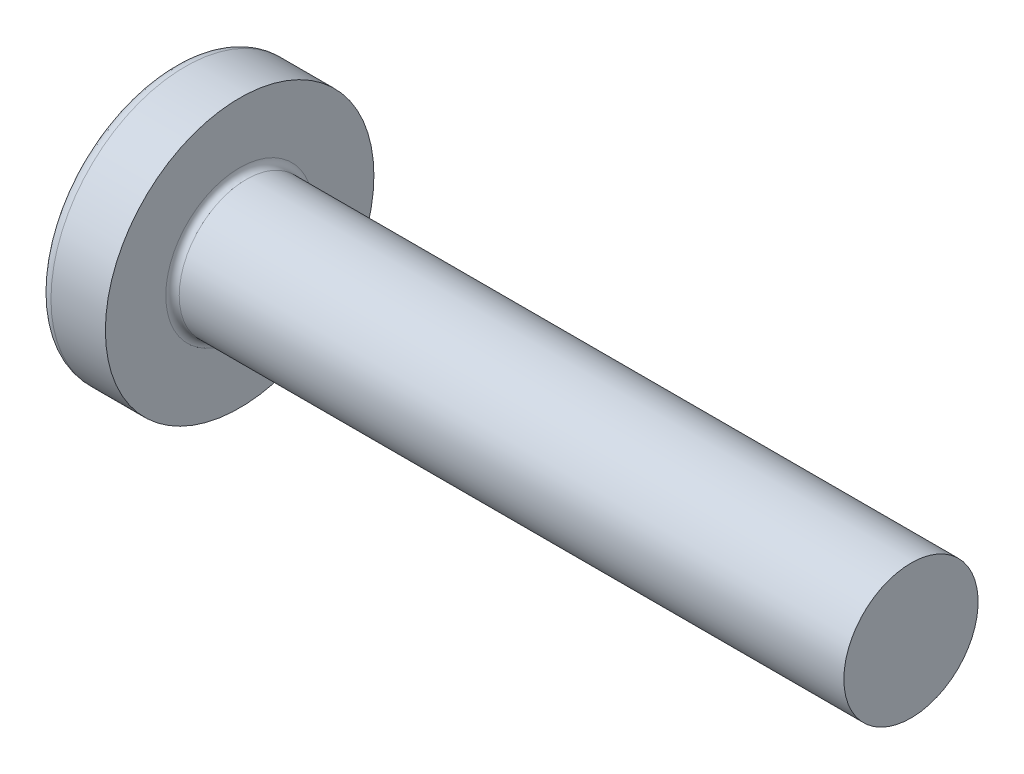
ISO-10303-21;
HEADER;
FILE_DESCRIPTION(('STEP AP214'),'2;1');
FILE_NAME('part.step','',(''),(''),'','','');
FILE_SCHEMA(('AUTOMOTIVE_DESIGN { 1 0 10303 214 1 1 1 1 }'));
ENDSEC;
DATA;
#1=APPLICATION_CONTEXT('core data for automotive mechanical design processes');
#2=APPLICATION_PROTOCOL_DEFINITION('international standard','automotive_design',2000,#1);
#3=PRODUCT_CONTEXT('',#1,'mechanical');
#4=PRODUCT('Part','Part','',(#3));
#5=PRODUCT_RELATED_PRODUCT_CATEGORY('part','',(#4));
#6=PRODUCT_DEFINITION_FORMATION('','',#4);
#7=PRODUCT_DEFINITION_CONTEXT('part definition',#1,'design');
#8=PRODUCT_DEFINITION('design','',#6,#7);
#9=PRODUCT_DEFINITION_SHAPE('','',#8);
#10=(LENGTH_UNIT() NAMED_UNIT(*) SI_UNIT(.MILLI.,.METRE.));
#11=(NAMED_UNIT(*) PLANE_ANGLE_UNIT() SI_UNIT($,.RADIAN.));
#12=(NAMED_UNIT(*) SI_UNIT($,.STERADIAN.) SOLID_ANGLE_UNIT());
#13=UNCERTAINTY_MEASURE_WITH_UNIT(LENGTH_MEASURE(1.E-05),#10,'distance_accuracy_value','');
#14=(GEOMETRIC_REPRESENTATION_CONTEXT(3) GLOBAL_UNCERTAINTY_ASSIGNED_CONTEXT((#13)) GLOBAL_UNIT_ASSIGNED_CONTEXT((#10,
#11,#12)) REPRESENTATION_CONTEXT('',''));
#15=CARTESIAN_POINT('',(0.,0.,0.));
#16=DIRECTION('',(0.,0.,1.));
#17=DIRECTION('',(1.,0.,0.));
#18=AXIS2_PLACEMENT_3D('',#15,#16,#17);
#19=CARTESIAN_POINT('',(0.,1.05,0.24));
#20=DIRECTION('',(-0.388390606151692,-0.921494838321475,0.));
#21=DIRECTION('',(0.921494838321475,-0.388390606151692,0.));
#22=AXIS2_PLACEMENT_3D('',#19,#20,#21);
#23=PLANE('',#22);
#24=DIRECTION('',(0.,0.,1.));
#25=VECTOR('',#24,1.);
#26=CARTESIAN_POINT('',(1.42,0.4515,0.24));
#27=LINE('',#26,#25);
#28=CARTESIAN_POINT('',(1.42,0.4515,-0.24));
#29=VERTEX_POINT('',#28);
#30=CARTESIAN_POINT('',(1.42,0.4515,0.24));
#31=VERTEX_POINT('',#30);
#32=EDGE_CURVE('E157',#29,#31,#27,.T.);
#33=ORIENTED_EDGE('',*,*,#32,.T.);
#34=DIRECTION('',(0.921494838321475,-0.388390606151692,0.));
#35=VECTOR('',#34,1.);
#36=CARTESIAN_POINT('',(0.163567582431044,0.981059719658465,0.24));
#37=LINE('',#36,#35);
#38=CARTESIAN_POINT('',(0.163567582431044,0.981059719658465,0.24));
#39=VERTEX_POINT('',#38);
#40=EDGE_CURVE('E155',#39,#31,#37,.T.);
#41=ORIENTED_EDGE('',*,*,#40,.F.);
#42=CARTESIAN_POINT('',(0.163567582431044,0.981059719658465,0.24));
#43=CARTESIAN_POINT('',(0.155231443530141,0.984573226089585,0.120170491540018));
#44=CARTESIAN_POINT('',(0.155231443530141,0.984573226089585,0.));
#45=B_SPLINE_CURVE_WITH_KNOTS('',2,(#42,#43,#44),.UNSPECIFIED.,.F.,.F.,(3,3),(0.,1.),.UNSPECIFIED.);
#46=CARTESIAN_POINT('',(0.155231443530141,0.984573226089585,0.));
#47=VERTEX_POINT('',#46);
#48=EDGE_CURVE('E143',#39,#47,#45,.T.);
#49=ORIENTED_EDGE('',*,*,#48,.T.);
#50=CARTESIAN_POINT('',(0.155231443530141,0.984573226089585,0.));
#51=CARTESIAN_POINT('',(0.155231443530141,0.984573226089585,-0.120170491540018));
#52=CARTESIAN_POINT('',(0.163567582431044,0.981059719658465,-0.24));
#53=B_SPLINE_CURVE_WITH_KNOTS('',2,(#50,#51,#52),.UNSPECIFIED.,.F.,.F.,(3,3),(0.,1.),.UNSPECIFIED.);
#54=CARTESIAN_POINT('',(0.163567582431044,0.981059719658465,-0.24));
#55=VERTEX_POINT('',#54);
#56=EDGE_CURVE('E150',#47,#55,#53,.T.);
#57=ORIENTED_EDGE('',*,*,#56,.T.);
#58=DIRECTION('',(-0.921494838321475,0.388390606151692,0.));
#59=VECTOR('',#58,1.);
#60=CARTESIAN_POINT('',(1.42,0.4515,-0.24));
#61=LINE('',#60,#59);
#62=EDGE_CURVE('E320',#29,#55,#61,.T.);
#63=ORIENTED_EDGE('',*,*,#62,.F.);
#64=EDGE_LOOP('',(#33,#41,#49,#57,#63));
#65=FACE_BOUND('',#64,.T.);
#66=ADVANCED_FACE('F15',(#65),#23,.T.);
#67=CARTESIAN_POINT('',(1.42,-0.4515,0.24));
#68=DIRECTION('',(0.,0.,-1.));
#69=DIRECTION('',(-1.,0.,0.));
#70=AXIS2_PLACEMENT_3D('',#67,#68,#69);
#71=PLANE('',#70);
#72=CARTESIAN_POINT('',(0.0321614467929396,0.383665089387867,0.24));
#73=CARTESIAN_POINT('',(0.0444976343759101,0.485334793650666,0.24));
#74=CARTESIAN_POINT('',(0.0616162394705707,0.585952531637949,0.24));
#75=CARTESIAN_POINT('',(0.105418284683272,0.785084075061481,0.24));
#76=CARTESIAN_POINT('',(0.132101724801313,0.883597880497731,0.239999999999999));
#77=CARTESIAN_POINT('',(0.163567582431044,0.981059719658465,0.239999999999999));
#78=B_SPLINE_CURVE_WITH_KNOTS('',3,(#72,#73,#74,#75,#76,#77),.UNSPECIFIED.,.F.,.F.,(4,2,4),(0.,
0.306190761687187,0.612381523374373),.UNSPECIFIED.);
#79=CARTESIAN_POINT('',(0.032161446788919,0.383665089389982,0.24));
#80=VERTEX_POINT('',#79);
#81=EDGE_CURVE('E147',#80,#39,#78,.T.);
#82=ORIENTED_EDGE('',*,*,#81,.T.);
#83=ORIENTED_EDGE('',*,*,#40,.T.);
#84=DIRECTION('',(0.,1.,0.));
#85=VECTOR('',#84,1.);
#86=CARTESIAN_POINT('',(1.42,-0.4515,0.24));
#87=LINE('',#86,#85);
#88=CARTESIAN_POINT('',(1.41999999999802,0.26225989018342,0.24));
#89=VERTEX_POINT('',#88);
#90=EDGE_CURVE('E165',#31,#89,#87,.F.);
#91=ORIENTED_EDGE('',*,*,#90,.T.);
#92=CARTESIAN_POINT('',(1.41999999999841,0.262259890181985,0.24));
#93=CARTESIAN_POINT('',(1.30971853065552,0.272703075671528,0.24));
#94=CARTESIAN_POINT('',(1.19941281358987,0.282885058267275,0.24));
#95=CARTESIAN_POINT('',(0.978765100194828,0.302838125701648,0.24));
#96=CARTESIAN_POINT('',(0.868423104182624,0.312609214041361,0.24));
#97=CARTESIAN_POINT('',(0.637110468045807,0.332776589227516,0.24));
#98=CARTESIAN_POINT('',(0.516137215606976,0.34314274696915,0.24));
#99=CARTESIAN_POINT('',(0.274165845082313,0.363594581443375,0.24));
#100=CARTESIAN_POINT('',(0.153167726776626,0.373680255578174,0.24));
#101=CARTESIAN_POINT('',(0.0321614467849463,0.383665089392646,0.24));
#102=B_SPLINE_CURVE_WITH_KNOTS('',3,(#92,#93,#94,#95,#96,#97,#98,#99,#100,#101),.UNSPECIFIED.,
.F.,.F.,(4,2,2,2,4),(0.,0.332323481469139,0.664644130753101,1.02889353261032,1.39314630695971),.UNSPECIFIED.);
#103=EDGE_CURVE('E163',#89,#80,#102,.T.);
#104=ORIENTED_EDGE('',*,*,#103,.T.);
#105=EDGE_LOOP('',(#82,#83,#91,#104));
#106=FACE_BOUND('',#105,.T.);
#107=ADVANCED_FACE('F161',(#106),#71,.T.);
#108=CARTESIAN_POINT('',(1.42,0.4515,-0.24));
#109=DIRECTION('',(0.,0.,1.));
#110=DIRECTION('',(1.,0.,0.));
#111=AXIS2_PLACEMENT_3D('',#108,#109,#110);
#112=PLANE('',#111);
#113=DIRECTION('',(0.,1.,0.));
#114=VECTOR('',#113,1.);
#115=CARTESIAN_POINT('',(1.42,0.4515,-0.24));
#116=LINE('',#115,#114);
#117=CARTESIAN_POINT('',(1.41999999999802,0.262259890183571,-0.239999999999834));
#118=VERTEX_POINT('',#117);
#119=EDGE_CURVE('E323',#118,#29,#116,.T.);
#120=ORIENTED_EDGE('',*,*,#119,.T.);
#121=ORIENTED_EDGE('',*,*,#62,.T.);
#122=CARTESIAN_POINT('',(0.163567582431044,0.981059719658465,-0.24));
#123=CARTESIAN_POINT('',(0.132101724801318,0.883597880497746,-0.240000000000018));
#124=CARTESIAN_POINT('',(0.105418284683281,0.785084075061511,-0.240000000000018));
#125=CARTESIAN_POINT('',(0.0616162394705814,0.585952531638008,-0.239999999999982));
#126=CARTESIAN_POINT('',(0.0444976343759199,0.485334793650741,-0.239999999999946));
#127=CARTESIAN_POINT('',(0.0321614467929466,0.383665089387958,-0.239999999999893));
#128=B_SPLINE_CURVE_WITH_KNOTS('',3,(#122,#123,#124,#125,#126,#127),.UNSPECIFIED.,.F.,.F.,(4,2,
4),(0.,0.306190761687141,0.612381523374282),.UNSPECIFIED.);
#129=CARTESIAN_POINT('',(0.0321614467804631,0.38366508939068,-0.239999999999999));
#130=VERTEX_POINT('',#129);
#131=EDGE_CURVE('E159',#55,#130,#128,.T.);
#132=ORIENTED_EDGE('',*,*,#131,.T.);
#133=CARTESIAN_POINT('',(0.0321614467848983,0.383665089392098,-0.24));
#134=CARTESIAN_POINT('',(0.172697148288459,0.372064034601761,-0.24));
#135=CARTESIAN_POINT('',(0.313222630717986,0.360333952818476,-0.24));
#136=CARTESIAN_POINT('',(0.594238285900295,0.336477810256283,-0.24));
#137=CARTESIAN_POINT('',(0.734728459040803,0.324351754035778,-0.24));
#138=CARTESIAN_POINT('',(0.966019988499014,0.303945294942037,-0.24));
#139=CARTESIAN_POINT('',(1.05683500417993,0.295820311838223,-0.24));
#140=CARTESIAN_POINT('',(1.23843898470996,0.279277294105801,-0.24));
#141=CARTESIAN_POINT('',(1.32922794935993,0.270859257294071,-0.24));
#142=CARTESIAN_POINT('',(1.4199999999988,0.262259890186309,-0.24));
#143=B_SPLINE_CURVE_WITH_KNOTS('',3,(#133,#134,#135,#136,#137,#138,#139,#140,#141,#142),
.UNSPECIFIED.,.F.,.F.,(4,2,2,2,4),(0.,0.423041758826345,0.846078649371156,1.11961147507662,
1.39314633891985),.UNSPECIFIED.);
#144=EDGE_CURVE('E315',#130,#118,#143,.T.);
#145=ORIENTED_EDGE('',*,*,#144,.T.);
#146=EDGE_LOOP('',(#120,#121,#132,#145));
#147=FACE_BOUND('',#146,.T.);
#148=ADVANCED_FACE('F504',(#147),#112,.T.);
#149=CARTESIAN_POINT('',(0.0321614468248299,0.,0.));
#150=DIRECTION('',(-1.,0.,0.));
#151=DIRECTION('',(0.,0.,1.));
#152=AXIS2_PLACEMENT_3D('',#149,#150,#151);
#153=CONICAL_SURFACE('',#152,0.452547125519231,0.0698131700840369);
#154=CARTESIAN_POINT('',(0.0321614467889213,0.239999999999998,0.383665089391767));
#155=CARTESIAN_POINT('',(0.172697148292394,0.239999999999998,0.372064034601435));
#156=CARTESIAN_POINT('',(0.313222630721834,0.239999999999998,0.360333952818154));
#157=CARTESIAN_POINT('',(0.594238285903967,0.239999999999999,0.336477810255969));
#158=CARTESIAN_POINT('',(0.734728459044388,0.239999999999999,0.324351754035467));
#159=CARTESIAN_POINT('',(0.966019988502024,0.239999999999999,0.30394529494177));
#160=CARTESIAN_POINT('',(1.05683500418246,0.239999999999999,0.295820311837996));
#161=CARTESIAN_POINT('',(1.23843898471151,0.239999999999999,0.279277294105659));
#162=CARTESIAN_POINT('',(1.32922794936099,0.239999999999999,0.270859257293972));
#163=CARTESIAN_POINT('',(1.41999999999937,0.239999999999999,0.262259890186256));
#164=B_SPLINE_CURVE_WITH_KNOTS('',3,(#154,#155,#156,#157,#158,#159,#160,#161,#162,#163),
.UNSPECIFIED.,.F.,.F.,(4,2,2,2,4),(0.,0.423041758826083,0.84607864937063,1.11961147507462,
1.39314633891639),.UNSPECIFIED.);
#165=CARTESIAN_POINT('',(0.0321614467784539,0.239999999999997,0.383665089339715));
#166=VERTEX_POINT('',#165);
#167=CARTESIAN_POINT('',(1.41999999999795,0.239999999999999,0.262259890183722));
#168=VERTEX_POINT('',#167);
#169=EDGE_CURVE('E308',#166,#168,#164,.T.);
#170=ORIENTED_EDGE('',*,*,#169,.F.);
#171=CARTESIAN_POINT('',(0.0321614467679865,0.,0.));
#172=DIRECTION('',(-1.,0.,0.));
#173=DIRECTION('',(0.,0.,1.));
#174=AXIS2_PLACEMENT_3D('',#171,#172,#173);
#175=CIRCLE('',#174,0.452547125523206);
#176=EDGE_CURVE('E319',#80,#166,#175,.F.);
#177=ORIENTED_EDGE('',*,*,#176,.F.);
#178=ORIENTED_EDGE('',*,*,#103,.F.);
#179=CARTESIAN_POINT('',(1.41999999999598,0.,0.));
#180=DIRECTION('',(-1.,0.,0.));
#181=DIRECTION('',(0.,0.,1.));
#182=AXIS2_PLACEMENT_3D('',#179,#180,#181);
#183=CIRCLE('',#182,0.355499999997733);
#184=EDGE_CURVE('E316',#168,#89,#183,.T.);
#185=ORIENTED_EDGE('',*,*,#184,.F.);
#186=EDGE_LOOP('',(#170,#177,#178,#185));
#187=FACE_BOUND('',#186,.T.);
#188=ADVANCED_FACE('F492',(#187),#153,.F.);
#189=CARTESIAN_POINT('',(0.0321614468248299,0.,0.));
#190=DIRECTION('',(-1.,0.,0.));
#191=DIRECTION('',(0.,0.,1.));
#192=AXIS2_PLACEMENT_3D('',#189,#190,#191);
#193=CONICAL_SURFACE('',#192,0.452547125519231,0.0698131700840369);
#194=CARTESIAN_POINT('',(1.41999999999905,0.240000000000001,-0.262259890181924));
#195=CARTESIAN_POINT('',(1.30971853065617,0.240000000000001,-0.272703075671467));
#196=CARTESIAN_POINT('',(1.19941281359054,0.240000000000001,-0.282885058267213));
#197=CARTESIAN_POINT('',(0.978765100195521,0.240000000000001,-0.302838125701586));
#198=CARTESIAN_POINT('',(0.868423104183331,0.240000000000001,-0.312609214041298));
#199=CARTESIAN_POINT('',(0.637110468047098,0.240000000000001,-0.332776589227403));
#200=CARTESIAN_POINT('',(0.516137215608838,0.240000000000001,-0.34314274696899));
#201=CARTESIAN_POINT('',(0.274165845085316,0.240000000000001,-0.363594581443123));
#202=CARTESIAN_POINT('',(0.153167726780199,0.240000000000001,-0.373680255577877));
#203=CARTESIAN_POINT('',(0.0321614467890897,0.240000000000001,-0.383665089392304));
#204=B_SPLINE_CURVE_WITH_KNOTS('',3,(#194,#195,#196,#197,#198,#199,#200,#201,#202,#203),
.UNSPECIFIED.,.F.,.F.,(4,2,2,2,4),(0.,0.332323481469098,0.664644130753018,1.02889353260852,
1.39314630695619),.UNSPECIFIED.);
#205=CARTESIAN_POINT('',(1.41999999999802,0.240000000000001,-0.262259890183419));
#206=VERTEX_POINT('',#205);
#207=CARTESIAN_POINT('',(0.0321614467679866,0.24,-0.383665089340576));
#208=VERTEX_POINT('',#207);
#209=EDGE_CURVE('E303',#206,#208,#204,.T.);
#210=ORIENTED_EDGE('',*,*,#209,.F.);
#211=CARTESIAN_POINT('',(1.41999999999598,0.,0.));
#212=DIRECTION('',(-1.,0.,0.));
#213=DIRECTION('',(0.,0.,1.));
#214=AXIS2_PLACEMENT_3D('',#211,#212,#213);
#215=CIRCLE('',#214,0.355499999997733);
#216=EDGE_CURVE('E311',#118,#206,#215,.T.);
#217=ORIENTED_EDGE('',*,*,#216,.F.);
#218=ORIENTED_EDGE('',*,*,#144,.F.);
#219=CARTESIAN_POINT('',(0.0321614467679865,0.,0.));
#220=DIRECTION('',(-1.,0.,0.));
#221=DIRECTION('',(0.,0.,1.));
#222=AXIS2_PLACEMENT_3D('',#219,#220,#221);
#223=CIRCLE('',#222,0.452547125523206);
#224=EDGE_CURVE('E314',#208,#130,#223,.F.);
#225=ORIENTED_EDGE('',*,*,#224,.F.);
#226=EDGE_LOOP('',(#210,#217,#218,#225));
#227=FACE_BOUND('',#226,.T.);
#228=ADVANCED_FACE('F489',(#227),#193,.F.);
#229=CARTESIAN_POINT('',(1.42,0.239999999999999,0.451500000000001));
#230=DIRECTION('',(0.,-1.,0.));
#231=DIRECTION('',(0.,0.,-1.));
#232=AXIS2_PLACEMENT_3D('',#229,#230,#231);
#233=PLANE('',#232);
#234=DIRECTION('',(0.,0.,-1.));
#235=VECTOR('',#234,1.);
#236=CARTESIAN_POINT('',(1.42,0.239999999999999,0.451500000000001));
#237=LINE('',#236,#235);
#238=CARTESIAN_POINT('',(1.42,0.239999999999997,0.451500000000001));
#239=VERTEX_POINT('',#238);
#240=EDGE_CURVE('E304',#168,#239,#237,.F.);
#241=ORIENTED_EDGE('',*,*,#240,.T.);
#242=DIRECTION('',(-0.921494838321475,0.,0.388390606151692));
#243=VECTOR('',#242,1.);
#244=CARTESIAN_POINT('',(0.,0.239999999999997,1.05));
#245=LINE('',#244,#243);
#246=CARTESIAN_POINT('',(0.163567582431044,0.239999999999996,0.981059719658466));
#247=VERTEX_POINT('',#246);
#248=EDGE_CURVE('E290',#247,#239,#245,.F.);
#249=ORIENTED_EDGE('',*,*,#248,.F.);
#250=CARTESIAN_POINT('',(3.2,0.239999999999996,0.));
#251=DIRECTION('',(0.,1.,0.));
#252=DIRECTION('',(0.,0.,1.));
#253=AXIS2_PLACEMENT_3D('',#250,#251,#252);
#254=CIRCLE('',#253,3.19098730802866);
#255=EDGE_CURVE('E777',#247,#166,#254,.F.);
#256=ORIENTED_EDGE('',*,*,#255,.T.);
#257=ORIENTED_EDGE('',*,*,#169,.T.);
#258=EDGE_LOOP('',(#241,#249,#256,#257));
#259=FACE_BOUND('',#258,.T.);
#260=ADVANCED_FACE('F473',(#259),#233,.T.);
#261=CARTESIAN_POINT('',(1.42,0.239999999999999,0.451500000000001));
#262=DIRECTION('',(0.,-1.,0.));
#263=DIRECTION('',(0.,0.,-1.));
#264=AXIS2_PLACEMENT_3D('',#261,#262,#263);
#265=PLANE('',#264);
#266=CARTESIAN_POINT('',(3.2,0.24,0.));
#267=DIRECTION('',(0.,1.,0.));
#268=DIRECTION('',(0.,0.,1.));
#269=AXIS2_PLACEMENT_3D('',#266,#267,#268);
#270=CIRCLE('',#269,3.19098730802866);
#271=CARTESIAN_POINT('',(0.163567582431044,0.240000000000002,-0.981059719658464));
#272=VERTEX_POINT('',#271);
#273=EDGE_CURVE('E461',#208,#272,#270,.F.);
#274=ORIENTED_EDGE('',*,*,#273,.T.);
#275=DIRECTION('',(0.921494838321475,0.,0.388390606151692));
#276=VECTOR('',#275,1.);
#277=CARTESIAN_POINT('',(1.42,0.240000000000001,-0.451499999999999));
#278=LINE('',#277,#276);
#279=CARTESIAN_POINT('',(1.42,0.240000000000001,-0.451499999999999));
#280=VERTEX_POINT('',#279);
#281=EDGE_CURVE('E280',#280,#272,#278,.F.);
#282=ORIENTED_EDGE('',*,*,#281,.F.);
#283=DIRECTION('',(0.,0.,-1.));
#284=VECTOR('',#283,1.);
#285=CARTESIAN_POINT('',(1.42,0.239999999999999,0.451500000000001));
#286=LINE('',#285,#284);
#287=EDGE_CURVE('E300',#280,#206,#286,.F.);
#288=ORIENTED_EDGE('',*,*,#287,.T.);
#289=ORIENTED_EDGE('',*,*,#209,.T.);
#290=EDGE_LOOP('',(#274,#282,#288,#289));
#291=FACE_BOUND('',#290,.T.);
#292=ADVANCED_FACE('F468',(#291),#265,.T.);
#293=CARTESIAN_POINT('',(0.,-0.240000000000004,1.05));
#294=DIRECTION('',(-0.388390606151692,0.,-0.921494838321475));
#295=DIRECTION('',(-0.921494838321475,0.,0.388390606151692));
#296=AXIS2_PLACEMENT_3D('',#293,#294,#295);
#297=PLANE('',#296);
#298=DIRECTION('',(0.,1.,0.));
#299=VECTOR('',#298,1.);
#300=CARTESIAN_POINT('',(1.42,-0.240000000000004,0.451499999999999));
#301=LINE('',#300,#299);
#302=CARTESIAN_POINT('',(1.42,-0.240000000000001,0.451499999999999));
#303=VERTEX_POINT('',#302);
#304=EDGE_CURVE('E293',#239,#303,#301,.F.);
#305=ORIENTED_EDGE('',*,*,#304,.T.);
#306=DIRECTION('',(0.921494838321475,0.,-0.388390606151692));
#307=VECTOR('',#306,1.);
#308=CARTESIAN_POINT('',(0.163567582431044,-0.240000000000003,0.981059719658464));
#309=LINE('',#308,#307);
#310=CARTESIAN_POINT('',(0.163567582431045,-0.240000000000004,0.981059719658465));
#311=VERTEX_POINT('',#310);
#312=EDGE_CURVE('E272',#311,#303,#309,.T.);
#313=ORIENTED_EDGE('',*,*,#312,.F.);
#314=CARTESIAN_POINT('',(0.163567582431045,-0.240000000000004,0.981059719658465));
#315=CARTESIAN_POINT('',(0.158010156497109,-0.160000000000005,0.983402057279211));
#316=CARTESIAN_POINT('',(0.155231443530141,-0.0800000000000063,0.984573226089584));
#317=CARTESIAN_POINT('',(0.155231443530141,0.079999999999991,0.984573226089586));
#318=CARTESIAN_POINT('',(0.158010156497109,0.15999999999999,0.983402057279215));
#319=CARTESIAN_POINT('',(0.163567582431045,0.239999999999988,0.981059719658472));
#320=B_SPLINE_CURVE_WITH_KNOTS('',3,(#314,#315,#316,#317,#318,#319),.UNSPECIFIED.,.F.,.F.,(4,2,
4),(0.,0.240170431026,0.480340862052),.UNSPECIFIED.);
#321=EDGE_CURVE('E294',#311,#247,#320,.T.);
#322=ORIENTED_EDGE('',*,*,#321,.T.);
#323=ORIENTED_EDGE('',*,*,#248,.T.);
#324=EDGE_LOOP('',(#305,#313,#322,#323));
#325=FACE_BOUND('',#324,.T.);
#326=ADVANCED_FACE('F463',(#325),#297,.T.);
#327=CARTESIAN_POINT('',(1.42,0.4515,0.24));
#328=DIRECTION('',(-1.,0.,0.));
#329=DIRECTION('',(0.,0.,1.));
#330=AXIS2_PLACEMENT_3D('',#327,#328,#329);
#331=PLANE('',#330);
#332=ORIENTED_EDGE('',*,*,#90,.F.);
#333=ORIENTED_EDGE('',*,*,#32,.F.);
#334=ORIENTED_EDGE('',*,*,#119,.F.);
#335=CARTESIAN_POINT('',(1.42000000000005,0.,0.));
#336=DIRECTION('',(-1.,0.,0.));
#337=DIRECTION('',(0.,0.,1.));
#338=AXIS2_PLACEMENT_3D('',#335,#336,#337);
#339=CIRCLE('',#338,0.355499999999509);
#340=EDGE_CURVE('E287',#118,#89,#339,.F.);
#341=ORIENTED_EDGE('',*,*,#340,.T.);
#342=EDGE_LOOP('',(#332,#333,#334,#341));
#343=FACE_BOUND('',#342,.T.);
#344=ADVANCED_FACE('F467',(#343),#331,.T.);
#345=CARTESIAN_POINT('',(1.42,0.240000000000001,-0.451499999999999));
#346=DIRECTION('',(-0.388390606151692,0.,0.921494838321475));
#347=DIRECTION('',(0.921494838321475,0.,0.388390606151692));
#348=AXIS2_PLACEMENT_3D('',#345,#346,#347);
#349=PLANE('',#348);
#350=DIRECTION('',(0.,1.,0.));
#351=VECTOR('',#350,1.);
#352=CARTESIAN_POINT('',(1.42,0.4515,-0.451499999999999));
#353=LINE('',#352,#351);
#354=CARTESIAN_POINT('',(1.42,-0.239999999999999,-0.4515));
#355=VERTEX_POINT('',#354);
#356=EDGE_CURVE('E271',#280,#355,#353,.F.);
#357=ORIENTED_EDGE('',*,*,#356,.F.);
#358=ORIENTED_EDGE('',*,*,#281,.T.);
#359=CARTESIAN_POINT('',(0.163567582431044,0.240000000000004,-0.981059719658464));
#360=CARTESIAN_POINT('',(0.158010156497109,0.160000000000004,-0.98340205727921));
#361=CARTESIAN_POINT('',(0.155231443530141,0.0800000000000041,-0.984573226089584));
#362=CARTESIAN_POINT('',(0.155231443530142,-0.0799999999999958,-0.984573226089587));
#363=CARTESIAN_POINT('',(0.15801015649711,-0.159999999999996,-0.983402057279216));
#364=CARTESIAN_POINT('',(0.163567582431047,-0.239999999999996,-0.981059719658473));
#365=B_SPLINE_CURVE_WITH_KNOTS('',3,(#359,#360,#361,#362,#363,#364),.UNSPECIFIED.,.F.,.F.,(4,2,
4),(0.,0.240170431026004,0.480340862052008),.UNSPECIFIED.);
#366=CARTESIAN_POINT('',(0.163567582431044,-0.239999999999995,-0.981059719658466));
#367=VERTEX_POINT('',#366);
#368=EDGE_CURVE('E283',#272,#367,#365,.T.);
#369=ORIENTED_EDGE('',*,*,#368,.T.);
#370=DIRECTION('',(-0.921494838321475,0.,-0.388390606151692));
#371=VECTOR('',#370,1.);
#372=CARTESIAN_POINT('',(1.42,-0.239999999999999,-0.451500000000001));
#373=LINE('',#372,#371);
#374=EDGE_CURVE('E256',#355,#367,#373,.T.);
#375=ORIENTED_EDGE('',*,*,#374,.F.);
#376=EDGE_LOOP('',(#357,#358,#369,#375));
#377=FACE_BOUND('',#376,.T.);
#378=ADVANCED_FACE('F429',(#377),#349,.T.);
#379=CARTESIAN_POINT('',(1.42,-0.239999999999999,-0.451500000000001));
#380=DIRECTION('',(0.,1.,0.));
#381=DIRECTION('',(0.,0.,1.));
#382=AXIS2_PLACEMENT_3D('',#379,#380,#381);
#383=PLANE('',#382);
#384=CARTESIAN_POINT('',(3.2,-0.240000000000002,0.));
#385=DIRECTION('',(0.,1.,0.));
#386=DIRECTION('',(0.,0.,1.));
#387=AXIS2_PLACEMENT_3D('',#384,#385,#386);
#388=CIRCLE('',#387,3.19098730802866);
#389=CARTESIAN_POINT('',(0.0321614467764451,-0.240000000000001,0.383665089339879));
#390=VERTEX_POINT('',#389);
#391=EDGE_CURVE('E277',#390,#311,#388,.T.);
#392=ORIENTED_EDGE('',*,*,#391,.T.);
#393=ORIENTED_EDGE('',*,*,#312,.T.);
#394=DIRECTION('',(0.,0.,1.));
#395=VECTOR('',#394,1.);
#396=CARTESIAN_POINT('',(1.42,-0.240000000000001,0.24));
#397=LINE('',#396,#395);
#398=CARTESIAN_POINT('',(1.41999999999953,-0.239999999999835,0.262259890183426));
#399=VERTEX_POINT('',#398);
#400=EDGE_CURVE('E268',#399,#303,#397,.T.);
#401=ORIENTED_EDGE('',*,*,#400,.F.);
#402=CARTESIAN_POINT('',(1.41999999999903,-0.240000000000001,0.262259890181926));
#403=CARTESIAN_POINT('',(1.30971853065615,-0.240000000000001,0.272703075671469));
#404=CARTESIAN_POINT('',(1.19941281359052,-0.240000000000001,0.282885058267215));
#405=CARTESIAN_POINT('',(0.978765100195498,-0.240000000000001,0.302838125701588));
#406=CARTESIAN_POINT('',(0.868423104183307,-0.240000000000001,0.3126092140413));
#407=CARTESIAN_POINT('',(0.637110468046388,-0.240000000000001,0.332776589227465));
#408=CARTESIAN_POINT('',(0.516137215607443,-0.240000000000001,0.34314274696911));
#409=CARTESIAN_POINT('',(0.274165845082549,-0.240000000000001,0.363594581443355));
#410=CARTESIAN_POINT('',(0.153167726776747,-0.240000000000001,0.373680255578164));
#411=CARTESIAN_POINT('',(0.0321614467849517,-0.240000000000001,0.383665089392645));
#412=B_SPLINE_CURVE_WITH_KNOTS('',3,(#402,#403,#404,#405,#406,#407,#408,#409,#410,#411),
.UNSPECIFIED.,.F.,.F.,(4,2,2,2,4),(0.,0.332323481469099,0.66464413075302,1.02889353261058,
1.39314630696032),.UNSPECIFIED.);
#413=EDGE_CURVE('E259',#399,#390,#412,.T.);
#414=ORIENTED_EDGE('',*,*,#413,.T.);
#415=EDGE_LOOP('',(#392,#393,#401,#414));
#416=FACE_BOUND('',#415,.T.);
#417=ADVANCED_FACE('F424',(#416),#383,.T.);
#418=CARTESIAN_POINT('',(1.42,0.4515,0.24));
#419=DIRECTION('',(-1.,0.,0.));
#420=DIRECTION('',(0.,0.,1.));
#421=AXIS2_PLACEMENT_3D('',#418,#419,#420);
#422=PLANE('',#421);
#423=ORIENTED_EDGE('',*,*,#400,.T.);
#424=ORIENTED_EDGE('',*,*,#304,.F.);
#425=ORIENTED_EDGE('',*,*,#240,.F.);
#426=CARTESIAN_POINT('',(1.42000000000002,0.,0.));
#427=DIRECTION('',(-1.,0.,0.));
#428=DIRECTION('',(0.,0.,1.));
#429=AXIS2_PLACEMENT_3D('',#426,#427,#428);
#430=CIRCLE('',#429,0.355499999999509);
#431=EDGE_CURVE('E255',#168,#399,#430,.F.);
#432=ORIENTED_EDGE('',*,*,#431,.T.);
#433=EDGE_LOOP('',(#423,#424,#425,#432));
#434=FACE_BOUND('',#433,.T.);
#435=ADVANCED_FACE('F420',(#434),#422,.T.);
#436=CARTESIAN_POINT('',(1.42,0.4515,0.24));
#437=DIRECTION('',(-1.,0.,0.));
#438=DIRECTION('',(0.,0.,1.));
#439=AXIS2_PLACEMENT_3D('',#436,#437,#438);
#440=PLANE('',#439);
#441=ORIENTED_EDGE('',*,*,#287,.F.);
#442=ORIENTED_EDGE('',*,*,#356,.T.);
#443=DIRECTION('',(0.,0.,1.));
#444=VECTOR('',#443,1.);
#445=CARTESIAN_POINT('',(1.42,-0.239999999999999,-0.451500000000001));
#446=LINE('',#445,#444);
#447=CARTESIAN_POINT('',(1.419999999998,-0.239999999999833,-0.262259890183572));
#448=VERTEX_POINT('',#447);
#449=EDGE_CURVE('E260',#448,#355,#446,.F.);
#450=ORIENTED_EDGE('',*,*,#449,.F.);
#451=CARTESIAN_POINT('',(1.42000000000002,0.,0.));
#452=DIRECTION('',(-1.,0.,0.));
#453=DIRECTION('',(0.,0.,1.));
#454=AXIS2_PLACEMENT_3D('',#451,#452,#453);
#455=CIRCLE('',#454,0.355499999999509);
#456=EDGE_CURVE('E254',#448,#206,#455,.F.);
#457=ORIENTED_EDGE('',*,*,#456,.T.);
#458=EDGE_LOOP('',(#441,#442,#450,#457));
#459=FACE_BOUND('',#458,.T.);
#460=ADVANCED_FACE('F415',(#459),#440,.T.);
#461=CARTESIAN_POINT('',(1.42,-0.239999999999999,-0.451500000000001));
#462=DIRECTION('',(0.,1.,0.));
#463=DIRECTION('',(0.,0.,1.));
#464=AXIS2_PLACEMENT_3D('',#461,#462,#463);
#465=PLANE('',#464);
#466=ORIENTED_EDGE('',*,*,#449,.T.);
#467=ORIENTED_EDGE('',*,*,#374,.T.);
#468=CARTESIAN_POINT('',(3.2,-0.239999999999996,0.));
#469=DIRECTION('',(0.,1.,0.));
#470=DIRECTION('',(0.,0.,1.));
#471=AXIS2_PLACEMENT_3D('',#468,#469,#470);
#472=CIRCLE('',#471,3.19098730802866);
#473=CARTESIAN_POINT('',(0.0321614467679865,-0.239999999999997,-0.383665089340578));
#474=VERTEX_POINT('',#473);
#475=EDGE_CURVE('E265',#367,#474,#472,.T.);
#476=ORIENTED_EDGE('',*,*,#475,.T.);
#477=CARTESIAN_POINT('',(0.0321614467849041,-0.239999999999999,-0.383665089392098));
#478=CARTESIAN_POINT('',(0.172697148288464,-0.239999999999999,-0.372064034601761));
#479=CARTESIAN_POINT('',(0.313222630717991,-0.239999999999999,-0.360333952818476));
#480=CARTESIAN_POINT('',(0.5942382859003,-0.239999999999999,-0.336477810256284));
#481=CARTESIAN_POINT('',(0.734728459040808,-0.239999999999999,-0.324351754035778));
#482=CARTESIAN_POINT('',(0.966019988499017,-0.239999999999999,-0.303945294942038));
#483=CARTESIAN_POINT('',(1.05683500417993,-0.239999999999999,-0.295820311838224));
#484=CARTESIAN_POINT('',(1.23843898470996,-0.239999999999999,-0.279277294105802));
#485=CARTESIAN_POINT('',(1.32922794935992,-0.239999999999999,-0.270859257294072));
#486=CARTESIAN_POINT('',(1.41999999999879,-0.239999999999999,-0.262259890186311));
#487=B_SPLINE_CURVE_WITH_KNOTS('',3,(#477,#478,#479,#480,#481,#482,#483,#484,#485,#486),
.UNSPECIFIED.,.F.,.F.,(4,2,2,2,4),(0.,0.423041758826345,0.846078649371155,1.11961147507661,
1.39314633891984),.UNSPECIFIED.);
#488=EDGE_CURVE('E251',#474,#448,#487,.T.);
#489=ORIENTED_EDGE('',*,*,#488,.T.);
#490=EDGE_LOOP('',(#466,#467,#476,#489));
#491=FACE_BOUND('',#490,.T.);
#492=ADVANCED_FACE('F410',(#491),#465,.T.);
#493=CARTESIAN_POINT('',(0.0321614468248299,0.,0.));
#494=DIRECTION('',(-1.,0.,0.));
#495=DIRECTION('',(0.,0.,1.));
#496=AXIS2_PLACEMENT_3D('',#493,#494,#495);
#497=CONICAL_SURFACE('',#496,0.452547125519231,0.0698131700840369);
#498=ORIENTED_EDGE('',*,*,#413,.F.);
#499=CARTESIAN_POINT('',(1.41999999999987,0.,0.));
#500=DIRECTION('',(-1.,0.,0.));
#501=DIRECTION('',(0.,0.,1.));
#502=AXIS2_PLACEMENT_3D('',#499,#500,#501);
#503=CIRCLE('',#502,0.355499999999509);
#504=CARTESIAN_POINT('',(1.41999999999977,-0.262259890183397,0.239999999999834));
#505=VERTEX_POINT('',#504);
#506=EDGE_CURVE('E252',#399,#505,#503,.F.);
#507=ORIENTED_EDGE('',*,*,#506,.T.);
#508=CARTESIAN_POINT('',(0.0321614467890338,-0.383665089391757,0.24));
#509=CARTESIAN_POINT('',(0.172697148292504,-0.372064034601424,0.24));
#510=CARTESIAN_POINT('',(0.313222630721941,-0.360333952818144,0.24));
#511=CARTESIAN_POINT('',(0.59423828590407,-0.336477810255959,0.24));
#512=CARTESIAN_POINT('',(0.734728459044488,-0.324351754035457,0.24));
#513=CARTESIAN_POINT('',(0.966019988502219,-0.303945294941751,0.24));
#514=CARTESIAN_POINT('',(1.05683500418275,-0.295820311837969,0.24));
#515=CARTESIAN_POINT('',(1.238438984712,-0.279277294105614,0.24));
#516=CARTESIAN_POINT('',(1.32922794936157,-0.270859257293917,0.24));
#517=CARTESIAN_POINT('',(1.42000000000005,-0.26225989018619,0.24));
#518=B_SPLINE_CURVE_WITH_KNOTS('',3,(#508,#509,#510,#511,#512,#513,#514,#515,#516,#517),
.UNSPECIFIED.,.F.,.F.,(4,2,2,2,4),(0.,0.423041758826075,0.846078649370615,1.1196114750749,
1.39314633891696),.UNSPECIFIED.);
#519=CARTESIAN_POINT('',(0.0321614467785101,-0.383665089392625,0.24));
#520=VERTEX_POINT('',#519);
#521=EDGE_CURVE('E245',#520,#505,#518,.T.);
#522=ORIENTED_EDGE('',*,*,#521,.F.);
#523=CARTESIAN_POINT('',(0.0321614467679865,0.,0.));
#524=DIRECTION('',(-1.,0.,0.));
#525=DIRECTION('',(0.,0.,1.));
#526=AXIS2_PLACEMENT_3D('',#523,#524,#525);
#527=CIRCLE('',#526,0.452547125523206);
#528=EDGE_CURVE('E441',#390,#520,#527,.F.);
#529=ORIENTED_EDGE('',*,*,#528,.F.);
#530=EDGE_LOOP('',(#498,#507,#522,#529));
#531=FACE_BOUND('',#530,.T.);
#532=ADVANCED_FACE('F414',(#531),#497,.F.);
#533=CARTESIAN_POINT('',(1.42000000000031,0.,0.));
#534=DIRECTION('',(-1.,0.,0.));
#535=DIRECTION('',(0.,0.,1.));
#536=AXIS2_PLACEMENT_3D('',#533,#534,#535);
#537=CONICAL_SURFACE('',#536,0.355499999998621,1.25663706143356);
#538=CARTESIAN_POINT('',(1.53550895201066,0.,0.));
#539=VERTEX_POINT('',#538);
#540=VERTEX_LOOP('',#539);
#541=FACE_BOUND('',#540,.T.);
#542=ORIENTED_EDGE('',*,*,#216,.T.);
#543=ORIENTED_EDGE('',*,*,#456,.F.);
#544=CARTESIAN_POINT('',(1.41999999999598,0.,0.));
#545=DIRECTION('',(-1.,0.,0.));
#546=DIRECTION('',(0.,0.,1.));
#547=AXIS2_PLACEMENT_3D('',#544,#545,#546);
#548=CIRCLE('',#547,0.355499999997733);
#549=CARTESIAN_POINT('',(1.419999999998,-0.26225989018342,-0.24));
#550=VERTEX_POINT('',#549);
#551=EDGE_CURVE('E248',#448,#550,#548,.T.);
#552=ORIENTED_EDGE('',*,*,#551,.T.);
#553=CARTESIAN_POINT('',(1.42000000000002,0.,0.));
#554=DIRECTION('',(-1.,0.,0.));
#555=DIRECTION('',(0.,0.,1.));
#556=AXIS2_PLACEMENT_3D('',#553,#554,#555);
#557=CIRCLE('',#556,0.355499999999509);
#558=EDGE_CURVE('E235',#505,#550,#557,.F.);
#559=ORIENTED_EDGE('',*,*,#558,.F.);
#560=ORIENTED_EDGE('',*,*,#506,.F.);
#561=ORIENTED_EDGE('',*,*,#431,.F.);
#562=ORIENTED_EDGE('',*,*,#184,.T.);
#563=ORIENTED_EDGE('',*,*,#340,.F.);
#564=EDGE_LOOP('',(#542,#543,#552,#559,#560,#561,#562,#563));
#565=FACE_BOUND('',#564,.T.);
#566=ADVANCED_FACE('F651',(#541,#565),#537,.F.);
#567=CARTESIAN_POINT('',(0.0321614468248299,0.,0.));
#568=DIRECTION('',(-1.,0.,0.));
#569=DIRECTION('',(0.,0.,1.));
#570=AXIS2_PLACEMENT_3D('',#567,#568,#569);
#571=CONICAL_SURFACE('',#570,0.452547125519231,0.0698131700840369);
#572=ORIENTED_EDGE('',*,*,#488,.F.);
#573=CARTESIAN_POINT('',(0.0321614467679865,0.,0.));
#574=DIRECTION('',(-1.,0.,0.));
#575=DIRECTION('',(0.,0.,1.));
#576=AXIS2_PLACEMENT_3D('',#573,#574,#575);
#577=CIRCLE('',#576,0.452547125523206);
#578=CARTESIAN_POINT('',(0.0321614467804782,-0.383665089390806,-0.24));
#579=VERTEX_POINT('',#578);
#580=EDGE_CURVE('E408',#579,#474,#577,.F.);
#581=ORIENTED_EDGE('',*,*,#580,.F.);
#582=CARTESIAN_POINT('',(1.41999999999905,-0.262259890181925,-0.24));
#583=CARTESIAN_POINT('',(1.30971853065617,-0.272703075671468,-0.24));
#584=CARTESIAN_POINT('',(1.19941281359053,-0.282885058267214,-0.24));
#585=CARTESIAN_POINT('',(0.978765100195515,-0.302838125701587,-0.24));
#586=CARTESIAN_POINT('',(0.868423104183325,-0.312609214041299,-0.24));
#587=CARTESIAN_POINT('',(0.637110468047092,-0.332776589227404,-0.24));
#588=CARTESIAN_POINT('',(0.516137215608831,-0.343142746968992,-0.24));
#589=CARTESIAN_POINT('',(0.274165845085308,-0.363594581443124,-0.239999999999999));
#590=CARTESIAN_POINT('',(0.153167726780191,-0.373680255577878,-0.239999999999999));
#591=CARTESIAN_POINT('',(0.0321614467890815,-0.383665089392305,-0.239999999999999));
#592=B_SPLINE_CURVE_WITH_KNOTS('',3,(#582,#583,#584,#585,#586,#587,#588,#589,#590,#591),
.UNSPECIFIED.,.F.,.F.,(4,2,2,2,4),(0.,0.332323481469098,0.664644130753018,1.02889353260852,
1.3931463069562),.UNSPECIFIED.);
#593=EDGE_CURVE('E234',#550,#579,#592,.T.);
#594=ORIENTED_EDGE('',*,*,#593,.F.);
#595=ORIENTED_EDGE('',*,*,#551,.F.);
#596=EDGE_LOOP('',(#572,#581,#594,#595));
#597=FACE_BOUND('',#596,.T.);
#598=ADVANCED_FACE('F383',(#597),#571,.F.);
#599=CARTESIAN_POINT('',(1.42,-0.4515,0.24));
#600=DIRECTION('',(0.,0.,-1.));
#601=DIRECTION('',(-1.,0.,0.));
#602=AXIS2_PLACEMENT_3D('',#599,#600,#601);
#603=PLANE('',#602);
#604=DIRECTION('',(0.,1.,0.));
#605=VECTOR('',#604,1.);
#606=CARTESIAN_POINT('',(1.42,0.4515,0.24));
#607=LINE('',#606,#605);
#608=CARTESIAN_POINT('',(1.42,-0.4515,0.24));
#609=VERTEX_POINT('',#608);
#610=EDGE_CURVE('E242',#609,#505,#607,.T.);
#611=ORIENTED_EDGE('',*,*,#610,.F.);
#612=DIRECTION('',(-0.921494838321475,-0.388390606151692,0.));
#613=VECTOR('',#612,1.);
#614=CARTESIAN_POINT('',(1.42,-0.4515,0.24));
#615=LINE('',#614,#613);
#616=CARTESIAN_POINT('',(0.163567582431044,-0.981059719658465,0.24));
#617=VERTEX_POINT('',#616);
#618=EDGE_CURVE('E225',#617,#609,#615,.F.);
#619=ORIENTED_EDGE('',*,*,#618,.F.);
#620=CARTESIAN_POINT('',(0.163567582431044,-0.981059719658465,0.239999999999999));
#621=CARTESIAN_POINT('',(0.132101724801332,-0.883597880497787,0.240000000000017));
#622=CARTESIAN_POINT('',(0.105418284683303,-0.785084075061593,0.240000000000017));
#623=CARTESIAN_POINT('',(0.0616162394706142,-0.585952531638175,0.239999999999983));
#624=CARTESIAN_POINT('',(0.0444976343759539,-0.485334793650951,0.239999999999948));
#625=CARTESIAN_POINT('',(0.0321614467929778,-0.383665089388212,0.239999999999895));
#626=B_SPLINE_CURVE_WITH_KNOTS('',3,(#620,#621,#622,#623,#624,#625),.UNSPECIFIED.,.F.,.F.,(4,2,
4),(0.,0.306190761687014,0.612381523374028),.UNSPECIFIED.);
#627=EDGE_CURVE('E250',#617,#520,#626,.T.);
#628=ORIENTED_EDGE('',*,*,#627,.T.);
#629=ORIENTED_EDGE('',*,*,#521,.T.);
#630=EDGE_LOOP('',(#611,#619,#628,#629));
#631=FACE_BOUND('',#630,.T.);
#632=ADVANCED_FACE('F379',(#631),#603,.T.);
#633=CARTESIAN_POINT('',(1.42,0.4515,0.24));
#634=DIRECTION('',(-1.,0.,0.));
#635=DIRECTION('',(0.,0.,1.));
#636=AXIS2_PLACEMENT_3D('',#633,#634,#635);
#637=PLANE('',#636);
#638=DIRECTION('',(0.,1.,0.));
#639=VECTOR('',#638,1.);
#640=CARTESIAN_POINT('',(1.42,0.4515,-0.24));
#641=LINE('',#640,#639);
#642=CARTESIAN_POINT('',(1.42,-0.4515,-0.24));
#643=VERTEX_POINT('',#642);
#644=EDGE_CURVE('E231',#643,#550,#641,.T.);
#645=ORIENTED_EDGE('',*,*,#644,.F.);
#646=DIRECTION('',(0.,0.,1.));
#647=VECTOR('',#646,1.);
#648=CARTESIAN_POINT('',(1.42,-0.4515,-0.24));
#649=LINE('',#648,#647);
#650=EDGE_CURVE('E222',#609,#643,#649,.F.);
#651=ORIENTED_EDGE('',*,*,#650,.F.);
#652=ORIENTED_EDGE('',*,*,#610,.T.);
#653=ORIENTED_EDGE('',*,*,#558,.T.);
#654=EDGE_LOOP('',(#645,#651,#652,#653));
#655=FACE_BOUND('',#654,.T.);
#656=ADVANCED_FACE('F374',(#655),#637,.T.);
#657=CARTESIAN_POINT('',(1.42,0.4515,-0.24));
#658=DIRECTION('',(0.,0.,1.));
#659=DIRECTION('',(1.,0.,0.));
#660=AXIS2_PLACEMENT_3D('',#657,#658,#659);
#661=PLANE('',#660);
#662=CARTESIAN_POINT('',(0.03216144679297,-0.38366508938812,-0.24));
#663=CARTESIAN_POINT('',(0.0444976343759438,-0.485334793650875,-0.24));
#664=CARTESIAN_POINT('',(0.0616162394706036,-0.585952531638115,-0.24));
#665=CARTESIAN_POINT('',(0.105418284683295,-0.785084075061563,-0.239999999999999));
#666=CARTESIAN_POINT('',(0.132101724801327,-0.883597880497772,-0.239999999999999));
#667=CARTESIAN_POINT('',(0.163567582431044,-0.981059719658465,-0.239999999999998));
#668=B_SPLINE_CURVE_WITH_KNOTS('',3,(#662,#663,#664,#665,#666,#667),.UNSPECIFIED.,.F.,.F.,(4,2,
4),(0.,0.30619076168706,0.612381523374119),.UNSPECIFIED.);
#669=CARTESIAN_POINT('',(0.163567582431044,-0.981059719658465,-0.24));
#670=VERTEX_POINT('',#669);
#671=EDGE_CURVE('E228',#579,#670,#668,.T.);
#672=ORIENTED_EDGE('',*,*,#671,.T.);
#673=DIRECTION('',(-0.921494838321475,-0.388390606151692,0.));
#674=VECTOR('',#673,1.);
#675=CARTESIAN_POINT('',(1.42,-0.4515,-0.24));
#676=LINE('',#675,#674);
#677=EDGE_CURVE('E205',#643,#670,#676,.T.);
#678=ORIENTED_EDGE('',*,*,#677,.F.);
#679=ORIENTED_EDGE('',*,*,#644,.T.);
#680=ORIENTED_EDGE('',*,*,#593,.T.);
#681=EDGE_LOOP('',(#672,#678,#679,#680));
#682=FACE_BOUND('',#681,.T.);
#683=ADVANCED_FACE('F370',(#682),#661,.T.);
#684=CARTESIAN_POINT('',(1.42,-0.4515,-0.24));
#685=DIRECTION('',(-0.388390606151692,0.921494838321475,0.));
#686=DIRECTION('',(-0.921494838321475,-0.388390606151692,0.));
#687=AXIS2_PLACEMENT_3D('',#684,#685,#686);
#688=PLANE('',#687);
#689=ORIENTED_EDGE('',*,*,#650,.T.);
#690=ORIENTED_EDGE('',*,*,#677,.T.);
#691=CARTESIAN_POINT('',(0.163567582431044,-0.981059719658465,-0.240000000000001));
#692=CARTESIAN_POINT('',(0.155231443530141,-0.984573226089585,-0.120170491540027));
#693=CARTESIAN_POINT('',(0.155231443530141,-0.984573226089585,0.));
#694=B_SPLINE_CURVE_WITH_KNOTS('',2,(#691,#692,#693),.UNSPECIFIED.,.F.,.F.,(3,3),(0.,1.),.UNSPECIFIED.);
#695=CARTESIAN_POINT('',(0.155231443530141,-0.984573226089585,0.));
#696=VERTEX_POINT('',#695);
#697=EDGE_CURVE('E200',#696,#670,#694,.F.);
#698=ORIENTED_EDGE('',*,*,#697,.F.);
#699=CARTESIAN_POINT('',(0.155231443530141,-0.984573226089585,0.));
#700=CARTESIAN_POINT('',(0.155231443530141,-0.984573226089585,0.120170491540027));
#701=CARTESIAN_POINT('',(0.163567582431044,-0.981059719658465,0.24));
#702=B_SPLINE_CURVE_WITH_KNOTS('',2,(#699,#700,#701),.UNSPECIFIED.,.F.,.F.,(3,3),(0.,1.),.UNSPECIFIED.);
#703=EDGE_CURVE('E204',#617,#696,#702,.F.);
#704=ORIENTED_EDGE('',*,*,#703,.F.);
#705=ORIENTED_EDGE('',*,*,#618,.T.);
#706=EDGE_LOOP('',(#689,#690,#698,#704,#705));
#707=FACE_BOUND('',#706,.T.);
#708=ADVANCED_FACE('F187',(#707),#688,.T.);
#709=CARTESIAN_POINT('',(3.2,0.,0.));
#710=DIRECTION('',(0.,1.,0.));
#711=DIRECTION('',(1.,0.,0.));
#712=AXIS2_PLACEMENT_3D('',#709,#710,#711);
#713=SPHERICAL_SURFACE('',#712,3.2);
#714=CARTESIAN_POINT('',(0.646379599446113,0.,0.));
#715=DIRECTION('',(-1.,0.,0.));
#716=DIRECTION('',(0.,0.,1.));
#717=AXIS2_PLACEMENT_3D('',#714,#715,#716);
#718=CIRCLE('',#717,1.92847682119205);
#719=CARTESIAN_POINT('',(0.646379599446113,0.,1.92847682119205));
#720=VERTEX_POINT('',#719);
#721=EDGE_CURVE('E214',#720,#720,#718,.F.);
#722=ORIENTED_EDGE('',*,*,#721,.F.);
#723=EDGE_LOOP('',(#722));
#724=FACE_BOUND('',#723,.T.);
#725=ORIENTED_EDGE('',*,*,#627,.F.);
#726=ORIENTED_EDGE('',*,*,#703,.T.);
#727=ORIENTED_EDGE('',*,*,#697,.T.);
#728=ORIENTED_EDGE('',*,*,#671,.F.);
#729=ORIENTED_EDGE('',*,*,#580,.T.);
#730=ORIENTED_EDGE('',*,*,#475,.F.);
#731=ORIENTED_EDGE('',*,*,#368,.F.);
#732=ORIENTED_EDGE('',*,*,#273,.F.);
#733=ORIENTED_EDGE('',*,*,#224,.T.);
#734=ORIENTED_EDGE('',*,*,#131,.F.);
#735=ORIENTED_EDGE('',*,*,#56,.F.);
#736=ORIENTED_EDGE('',*,*,#48,.F.);
#737=ORIENTED_EDGE('',*,*,#81,.F.);
#738=ORIENTED_EDGE('',*,*,#176,.T.);
#739=ORIENTED_EDGE('',*,*,#255,.F.);
#740=ORIENTED_EDGE('',*,*,#321,.F.);
#741=ORIENTED_EDGE('',*,*,#391,.F.);
#742=ORIENTED_EDGE('',*,*,#528,.T.);
#743=EDGE_LOOP('',(#725,#726,#727,#728,#729,#730,#731,#732,#733,#734,#735,#736,#737,#738,#739,
#740,#741,#742));
#744=FACE_BOUND('',#743,.T.);
#745=ADVANCED_FACE('F145',(#724,#744),#713,.T.);
#746=CARTESIAN_POINT('',(0.790020746977269,0.,0.));
#747=DIRECTION('',(-1.,0.,0.));
#748=DIRECTION('',(0.,0.,1.));
#749=AXIS2_PLACEMENT_3D('',#746,#747,#748);
#750=TOROIDAL_SURFACE('',#749,1.82,0.18);
#751=ORIENTED_EDGE('',*,*,#721,.T.);
#752=EDGE_LOOP('',(#751));
#753=FACE_BOUND('',#752,.T.);
#754=CARTESIAN_POINT('',(0.790020746977269,0.,0.));
#755=DIRECTION('',(-1.,0.,0.));
#756=DIRECTION('',(0.,0.,1.));
#757=AXIS2_PLACEMENT_3D('',#754,#755,#756);
#758=CIRCLE('',#757,2.);
#759=CARTESIAN_POINT('',(0.790020746977269,0.,2.));
#760=VERTEX_POINT('',#759);
#761=EDGE_CURVE('E356',#760,#760,#758,.F.);
#762=ORIENTED_EDGE('',*,*,#761,.F.);
#763=EDGE_LOOP('',(#762));
#764=FACE_BOUND('',#763,.T.);
#765=ADVANCED_FACE('F186',(#753,#764),#750,.T.);
#766=CARTESIAN_POINT('',(0.,0.,0.));
#767=DIRECTION('',(-1.,0.,0.));
#768=DIRECTION('',(0.,0.,1.));
#769=AXIS2_PLACEMENT_3D('',#766,#767,#768);
#770=CYLINDRICAL_SURFACE('',#769,2.);
#771=ORIENTED_EDGE('',*,*,#761,.T.);
#772=EDGE_LOOP('',(#771));
#773=FACE_BOUND('',#772,.T.);
#774=CARTESIAN_POINT('',(1.6,0.,0.));
#775=DIRECTION('',(-1.,0.,0.));
#776=DIRECTION('',(0.,0.,1.));
#777=AXIS2_PLACEMENT_3D('',#774,#775,#776);
#778=CIRCLE('',#777,2.);
#779=CARTESIAN_POINT('',(1.6,0.,2.));
#780=VERTEX_POINT('',#779);
#781=EDGE_CURVE('E352',#780,#780,#778,.T.);
#782=ORIENTED_EDGE('',*,*,#781,.T.);
#783=EDGE_LOOP('',(#782));
#784=FACE_BOUND('',#783,.T.);
#785=ADVANCED_FACE('F546',(#773,#784),#770,.T.);
#786=CARTESIAN_POINT('',(1.6,1.,0.));
#787=DIRECTION('',(-1.,0.,0.));
#788=DIRECTION('',(0.,0.,1.));
#789=AXIS2_PLACEMENT_3D('',#786,#787,#788);
#790=PLANE('',#789);
#791=ORIENTED_EDGE('',*,*,#781,.F.);
#792=EDGE_LOOP('',(#791));
#793=FACE_BOUND('',#792,.T.);
#794=CARTESIAN_POINT('',(1.6,0.,0.));
#795=DIRECTION('',(1.,0.,0.));
#796=DIRECTION('',(0.,0.,1.));
#797=AXIS2_PLACEMENT_3D('',#794,#795,#796);
#798=CIRCLE('',#797,1.1);
#799=CARTESIAN_POINT('',(1.6,0.,-1.1));
#800=VERTEX_POINT('',#799);
#801=CARTESIAN_POINT('',(1.6,0.,1.1));
#802=VERTEX_POINT('',#801);
#803=EDGE_CURVE('E355',#800,#802,#798,.F.);
#804=ORIENTED_EDGE('',*,*,#803,.T.);
#805=CARTESIAN_POINT('',(1.6,0.,0.));
#806=DIRECTION('',(1.,0.,0.));
#807=DIRECTION('',(0.,0.,-1.));
#808=AXIS2_PLACEMENT_3D('',#805,#806,#807);
#809=CIRCLE('',#808,1.1);
#810=EDGE_CURVE('E35',#802,#800,#809,.F.);
#811=ORIENTED_EDGE('',*,*,#810,.T.);
#812=EDGE_LOOP('',(#804,#811));
#813=FACE_BOUND('',#812,.T.);
#814=ADVANCED_FACE('F538',(#793,#813),#790,.F.);
#815=CARTESIAN_POINT('',(11.6,0.,0.));
#816=DIRECTION('',(-1.,0.,0.));
#817=DIRECTION('',(0.,0.,1.));
#818=AXIS2_PLACEMENT_3D('',#815,#816,#817);
#819=PLANE('',#818);
#820=CARTESIAN_POINT('',(11.6,0.,0.));
#821=DIRECTION('',(-1.,0.,0.));
#822=DIRECTION('',(0.,0.,1.));
#823=AXIS2_PLACEMENT_3D('',#820,#821,#822);
#824=CIRCLE('',#823,1.);
#825=CARTESIAN_POINT('',(11.6,0.,1.));
#826=VERTEX_POINT('',#825);
#827=EDGE_CURVE('E27',#826,#826,#824,.T.);
#828=ORIENTED_EDGE('',*,*,#827,.F.);
#829=EDGE_LOOP('',(#828));
#830=FACE_BOUND('',#829,.T.);
#831=ADVANCED_FACE('F523',(#830),#819,.F.);
#832=CARTESIAN_POINT('',(1.7,0.,0.));
#833=DIRECTION('',(-1.,0.,0.));
#834=DIRECTION('',(0.,0.,1.));
#835=AXIS2_PLACEMENT_3D('',#832,#833,#834);
#836=TOROIDAL_SURFACE('',#835,1.1,0.1);
#837=ORIENTED_EDGE('',*,*,#810,.F.);
#838=ORIENTED_EDGE('',*,*,#803,.F.);
#839=EDGE_LOOP('',(#837,#838));
#840=FACE_BOUND('',#839,.T.);
#841=CARTESIAN_POINT('',(1.7,0.,0.));
#842=DIRECTION('',(-1.,0.,0.));
#843=DIRECTION('',(0.,0.,1.));
#844=AXIS2_PLACEMENT_3D('',#841,#842,#843);
#845=CIRCLE('',#844,1.);
#846=CARTESIAN_POINT('',(1.7,0.,1.));
#847=VERTEX_POINT('',#846);
#848=EDGE_CURVE('E10',#847,#847,#845,.F.);
#849=ORIENTED_EDGE('',*,*,#848,.F.);
#850=EDGE_LOOP('',(#849));
#851=FACE_BOUND('',#850,.T.);
#852=ADVANCED_FACE('F517',(#840,#851),#836,.F.);
#853=CARTESIAN_POINT('',(0.,0.,0.));
#854=DIRECTION('',(-1.,0.,0.));
#855=DIRECTION('',(0.,0.,1.));
#856=AXIS2_PLACEMENT_3D('',#853,#854,#855);
#857=CYLINDRICAL_SURFACE('',#856,1.);
#858=ORIENTED_EDGE('',*,*,#848,.T.);
#859=EDGE_LOOP('',(#858));
#860=FACE_BOUND('',#859,.T.);
#861=ORIENTED_EDGE('',*,*,#827,.T.);
#862=EDGE_LOOP('',(#861));
#863=FACE_BOUND('',#862,.T.);
#864=ADVANCED_FACE('F515',(#860,#863),#857,.T.);
#865=CLOSED_SHELL('',(#66,#107,#148,#188,#228,#260,#292,#326,#344,#378,#417,#435,#460,#492,#532,
#566,#598,#632,#656,#683,#708,#745,#765,#785,#814,#831,#852,#864));
#866=MANIFOLD_SOLID_BREP('B1',#865);
#867=ADVANCED_BREP_SHAPE_REPRESENTATION('',(#18,#866),#14);
#868=SHAPE_DEFINITION_REPRESENTATION(#9,#867);
ENDSEC;
END-ISO-10303-21;
